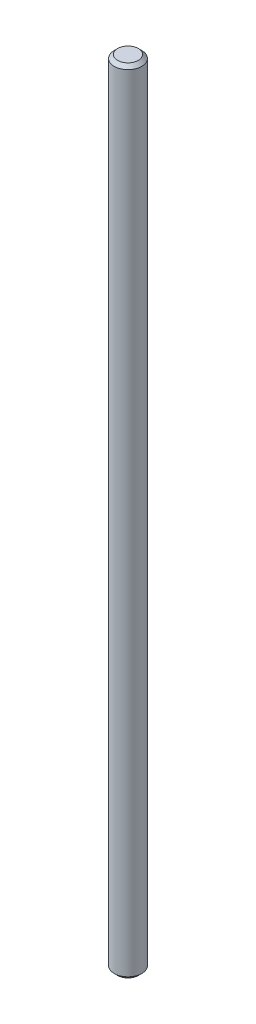
ISO-10303-21;
HEADER;
FILE_DESCRIPTION(('STEP AP214'),'2;1');
FILE_NAME('part.step','',(''),(''),'','','');
FILE_SCHEMA(('AUTOMOTIVE_DESIGN { 1 0 10303 214 1 1 1 1 }'));
ENDSEC;
DATA;
#1=APPLICATION_CONTEXT('core data for automotive mechanical design processes');
#2=APPLICATION_PROTOCOL_DEFINITION('international standard','automotive_design',2000,#1);
#3=PRODUCT_CONTEXT('',#1,'mechanical');
#4=PRODUCT('Part','Part','',(#3));
#5=PRODUCT_RELATED_PRODUCT_CATEGORY('part','',(#4));
#6=PRODUCT_DEFINITION_FORMATION('','',#4);
#7=PRODUCT_DEFINITION_CONTEXT('part definition',#1,'design');
#8=PRODUCT_DEFINITION('design','',#6,#7);
#9=PRODUCT_DEFINITION_SHAPE('','',#8);
#10=(LENGTH_UNIT() NAMED_UNIT(*) SI_UNIT(.MILLI.,.METRE.));
#11=(NAMED_UNIT(*) PLANE_ANGLE_UNIT() SI_UNIT($,.RADIAN.));
#12=(NAMED_UNIT(*) SI_UNIT($,.STERADIAN.) SOLID_ANGLE_UNIT());
#13=UNCERTAINTY_MEASURE_WITH_UNIT(LENGTH_MEASURE(1.E-05),#10,'distance_accuracy_value','');
#14=(GEOMETRIC_REPRESENTATION_CONTEXT(3) GLOBAL_UNCERTAINTY_ASSIGNED_CONTEXT((#13)) GLOBAL_UNIT_ASSIGNED_CONTEXT((#10,
#11,#12)) REPRESENTATION_CONTEXT('',''));
#15=CARTESIAN_POINT('',(0.,0.,0.));
#16=DIRECTION('',(0.,0.,1.));
#17=DIRECTION('',(1.,0.,0.));
#18=AXIS2_PLACEMENT_3D('',#15,#16,#17);
#19=CARTESIAN_POINT('',(0.,230.,0.));
#20=DIRECTION('',(0.,-1.,0.));
#21=DIRECTION('',(0.,0.,-1.));
#22=AXIS2_PLACEMENT_3D('',#19,#20,#21);
#23=CYLINDRICAL_SURFACE('',#22,4.);
#24=CARTESIAN_POINT('',(0.,1.00000000000006,0.));
#25=DIRECTION('',(0.,1.,0.));
#26=DIRECTION('',(0.,0.,1.));
#27=AXIS2_PLACEMENT_3D('',#24,#25,#26);
#28=CIRCLE('',#27,4.);
#29=CARTESIAN_POINT('',(0.,1.00000000000006,4.));
#30=VERTEX_POINT('',#29);
#31=EDGE_CURVE('E47',#30,#30,#28,.T.);
#32=ORIENTED_EDGE('',*,*,#31,.T.);
#33=EDGE_LOOP('',(#32));
#34=FACE_BOUND('',#33,.T.);
#35=CARTESIAN_POINT('',(0.,229.,0.));
#36=DIRECTION('',(0.,1.,0.));
#37=DIRECTION('',(0.,0.,1.));
#38=AXIS2_PLACEMENT_3D('',#35,#36,#37);
#39=CIRCLE('',#38,4.);
#40=CARTESIAN_POINT('',(0.,229.,4.));
#41=VERTEX_POINT('',#40);
#42=EDGE_CURVE('E51',#41,#41,#39,.F.);
#43=ORIENTED_EDGE('',*,*,#42,.T.);
#44=EDGE_LOOP('',(#43));
#45=FACE_BOUND('',#44,.T.);
#46=ADVANCED_FACE('F35',(#34,#45),#23,.T.);
#47=CARTESIAN_POINT('',(0.,230.,0.));
#48=DIRECTION('',(0.,1.,0.));
#49=DIRECTION('',(0.,0.,1.));
#50=AXIS2_PLACEMENT_3D('',#47,#48,#49);
#51=PLANE('',#50);
#52=CARTESIAN_POINT('',(0.,230.,0.));
#53=DIRECTION('',(0.,1.,0.));
#54=DIRECTION('',(0.,0.,1.));
#55=AXIS2_PLACEMENT_3D('',#52,#53,#54);
#56=CIRCLE('',#55,3.);
#57=CARTESIAN_POINT('',(0.,230.,3.));
#58=VERTEX_POINT('',#57);
#59=EDGE_CURVE('E10',#58,#58,#56,.T.);
#60=ORIENTED_EDGE('',*,*,#59,.T.);
#61=EDGE_LOOP('',(#60));
#62=FACE_BOUND('',#61,.T.);
#63=ADVANCED_FACE('F67',(#62),#51,.T.);
#64=CARTESIAN_POINT('',(0.,0.,0.));
#65=DIRECTION('',(0.,1.,0.));
#66=DIRECTION('',(0.,0.,1.));
#67=AXIS2_PLACEMENT_3D('',#64,#65,#66);
#68=PLANE('',#67);
#69=CARTESIAN_POINT('',(0.,0.,0.));
#70=DIRECTION('',(0.,1.,0.));
#71=DIRECTION('',(0.,0.,1.));
#72=AXIS2_PLACEMENT_3D('',#69,#70,#71);
#73=CIRCLE('',#72,2.99999999999995);
#74=CARTESIAN_POINT('',(0.,0.,2.99999999999995));
#75=VERTEX_POINT('',#74);
#76=EDGE_CURVE('E43',#75,#75,#73,.F.);
#77=ORIENTED_EDGE('',*,*,#76,.T.);
#78=EDGE_LOOP('',(#77));
#79=FACE_BOUND('',#78,.T.);
#80=ADVANCED_FACE('F64',(#79),#68,.F.);
#81=CARTESIAN_POINT('',(0.,1.00000000000006,0.));
#82=DIRECTION('',(0.,1.,0.));
#83=DIRECTION('',(0.,0.,1.));
#84=AXIS2_PLACEMENT_3D('',#81,#82,#83);
#85=CONICAL_SURFACE('',#84,4.,0.785398163397447);
#86=ORIENTED_EDGE('',*,*,#76,.F.);
#87=EDGE_LOOP('',(#86));
#88=FACE_BOUND('',#87,.T.);
#89=ORIENTED_EDGE('',*,*,#31,.F.);
#90=EDGE_LOOP('',(#89));
#91=FACE_BOUND('',#90,.T.);
#92=ADVANCED_FACE('F60',(#88,#91),#85,.T.);
#93=CARTESIAN_POINT('',(0.,230.,0.));
#94=DIRECTION('',(0.,-1.,0.));
#95=DIRECTION('',(0.,0.,-1.));
#96=AXIS2_PLACEMENT_3D('',#93,#94,#95);
#97=CONICAL_SURFACE('',#96,3.,0.785398163397433);
#98=ORIENTED_EDGE('',*,*,#42,.F.);
#99=EDGE_LOOP('',(#98));
#100=FACE_BOUND('',#99,.T.);
#101=ORIENTED_EDGE('',*,*,#59,.F.);
#102=EDGE_LOOP('',(#101));
#103=FACE_BOUND('',#102,.T.);
#104=ADVANCED_FACE('F38',(#100,#103),#97,.T.);
#105=CLOSED_SHELL('',(#46,#63,#80,#92,#104));
#106=MANIFOLD_SOLID_BREP('B2',#105);
#107=ADVANCED_BREP_SHAPE_REPRESENTATION('',(#18,#106),#14);
#108=SHAPE_DEFINITION_REPRESENTATION(#9,#107);
ENDSEC;
END-ISO-10303-21;
